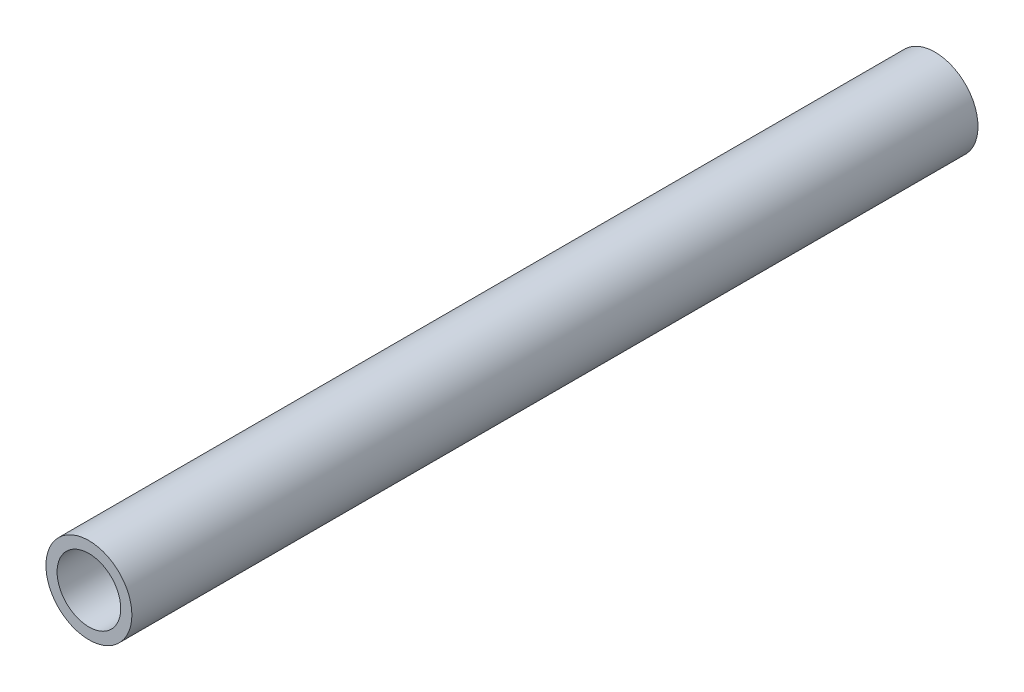
ISO-10303-21;
HEADER;
FILE_DESCRIPTION(('STEP AP214'),'2;1');
FILE_NAME('part.step','',(''),(''),'','','');
FILE_SCHEMA(('AUTOMOTIVE_DESIGN { 1 0 10303 214 1 1 1 1 }'));
ENDSEC;
DATA;
#1=APPLICATION_CONTEXT('core data for automotive mechanical design processes');
#2=APPLICATION_PROTOCOL_DEFINITION('international standard','automotive_design',2000,#1);
#3=PRODUCT_CONTEXT('',#1,'mechanical');
#4=PRODUCT('Part','Part','',(#3));
#5=PRODUCT_RELATED_PRODUCT_CATEGORY('part','',(#4));
#6=PRODUCT_DEFINITION_FORMATION('','',#4);
#7=PRODUCT_DEFINITION_CONTEXT('part definition',#1,'design');
#8=PRODUCT_DEFINITION('design','',#6,#7);
#9=PRODUCT_DEFINITION_SHAPE('','',#8);
#10=(LENGTH_UNIT() NAMED_UNIT(*) SI_UNIT(.MILLI.,.METRE.));
#11=(NAMED_UNIT(*) PLANE_ANGLE_UNIT() SI_UNIT($,.RADIAN.));
#12=(NAMED_UNIT(*) SI_UNIT($,.STERADIAN.) SOLID_ANGLE_UNIT());
#13=UNCERTAINTY_MEASURE_WITH_UNIT(LENGTH_MEASURE(1.E-05),#10,'distance_accuracy_value','');
#14=(GEOMETRIC_REPRESENTATION_CONTEXT(3) GLOBAL_UNCERTAINTY_ASSIGNED_CONTEXT((#13)) GLOBAL_UNIT_ASSIGNED_CONTEXT((#10,
#11,#12)) REPRESENTATION_CONTEXT('',''));
#15=CARTESIAN_POINT('',(0.,0.,0.));
#16=DIRECTION('',(0.,0.,1.));
#17=DIRECTION('',(1.,0.,0.));
#18=AXIS2_PLACEMENT_3D('',#15,#16,#17);
#19=CARTESIAN_POINT('',(0.,0.,105.));
#20=DIRECTION('',(0.,0.,1.));
#21=DIRECTION('',(1.,0.,0.));
#22=AXIS2_PLACEMENT_3D('',#19,#20,#21);
#23=PLANE('',#22);
#24=CARTESIAN_POINT('',(0.,0.,105.));
#25=DIRECTION('',(0.,0.,1.));
#26=DIRECTION('',(1.,0.,0.));
#27=AXIS2_PLACEMENT_3D('',#24,#25,#26);
#28=CIRCLE('',#27,10.668);
#29=CARTESIAN_POINT('',(10.668,0.,105.));
#30=VERTEX_POINT('',#29);
#31=EDGE_CURVE('E11',#30,#30,#28,.T.);
#32=ORIENTED_EDGE('',*,*,#31,.T.);
#33=EDGE_LOOP('',(#32));
#34=FACE_BOUND('',#33,.T.);
#35=CARTESIAN_POINT('',(0.,0.,105.));
#36=DIRECTION('',(0.,0.,1.));
#37=DIRECTION('',(1.,0.,0.));
#38=AXIS2_PLACEMENT_3D('',#35,#36,#37);
#39=CIRCLE('',#38,7.8994);
#40=CARTESIAN_POINT('',(7.8994,0.,105.));
#41=VERTEX_POINT('',#40);
#42=EDGE_CURVE('E48',#41,#41,#39,.T.);
#43=ORIENTED_EDGE('',*,*,#42,.F.);
#44=EDGE_LOOP('',(#43));
#45=FACE_BOUND('',#44,.T.);
#46=ADVANCED_FACE('F37',(#34,#45),#23,.T.);
#47=CARTESIAN_POINT('',(0.,0.,-105.));
#48=DIRECTION('',(0.,0.,1.));
#49=DIRECTION('',(1.,0.,0.));
#50=AXIS2_PLACEMENT_3D('',#47,#48,#49);
#51=PLANE('',#50);
#52=CARTESIAN_POINT('',(0.,0.,-105.));
#53=DIRECTION('',(0.,0.,1.));
#54=DIRECTION('',(1.,0.,0.));
#55=AXIS2_PLACEMENT_3D('',#52,#53,#54);
#56=CIRCLE('',#55,10.668);
#57=CARTESIAN_POINT('',(10.668,0.,-105.));
#58=VERTEX_POINT('',#57);
#59=EDGE_CURVE('E41',#58,#58,#56,.T.);
#60=ORIENTED_EDGE('',*,*,#59,.F.);
#61=EDGE_LOOP('',(#60));
#62=FACE_BOUND('',#61,.T.);
#63=CARTESIAN_POINT('',(0.,0.,-105.));
#64=DIRECTION('',(0.,0.,1.));
#65=DIRECTION('',(1.,0.,0.));
#66=AXIS2_PLACEMENT_3D('',#63,#64,#65);
#67=CIRCLE('',#66,7.8994);
#68=CARTESIAN_POINT('',(7.8994,0.,-105.));
#69=VERTEX_POINT('',#68);
#70=EDGE_CURVE('E50',#69,#69,#67,.T.);
#71=ORIENTED_EDGE('',*,*,#70,.T.);
#72=EDGE_LOOP('',(#71));
#73=FACE_BOUND('',#72,.T.);
#74=ADVANCED_FACE('F60',(#62,#73),#51,.F.);
#75=CARTESIAN_POINT('',(0.,0.,105.));
#76=DIRECTION('',(0.,0.,-1.));
#77=DIRECTION('',(-1.,0.,0.));
#78=AXIS2_PLACEMENT_3D('',#75,#76,#77);
#79=CYLINDRICAL_SURFACE('',#78,10.668);
#80=ORIENTED_EDGE('',*,*,#31,.F.);
#81=EDGE_LOOP('',(#80));
#82=FACE_BOUND('',#81,.T.);
#83=ORIENTED_EDGE('',*,*,#59,.T.);
#84=EDGE_LOOP('',(#83));
#85=FACE_BOUND('',#84,.T.);
#86=ADVANCED_FACE('F39',(#82,#85),#79,.T.);
#87=CARTESIAN_POINT('',(0.,0.,105.));
#88=DIRECTION('',(0.,0.,-1.));
#89=DIRECTION('',(-1.,0.,0.));
#90=AXIS2_PLACEMENT_3D('',#87,#88,#89);
#91=CYLINDRICAL_SURFACE('',#90,7.8994);
#92=ORIENTED_EDGE('',*,*,#42,.T.);
#93=EDGE_LOOP('',(#92));
#94=FACE_BOUND('',#93,.T.);
#95=ORIENTED_EDGE('',*,*,#70,.F.);
#96=EDGE_LOOP('',(#95));
#97=FACE_BOUND('',#96,.T.);
#98=ADVANCED_FACE('F56',(#94,#97),#91,.F.);
#99=CLOSED_SHELL('',(#46,#74,#86,#98));
#100=MANIFOLD_SOLID_BREP('B2',#99);
#101=ADVANCED_BREP_SHAPE_REPRESENTATION('',(#18,#100),#14);
#102=SHAPE_DEFINITION_REPRESENTATION(#9,#101);
ENDSEC;
END-ISO-10303-21;
